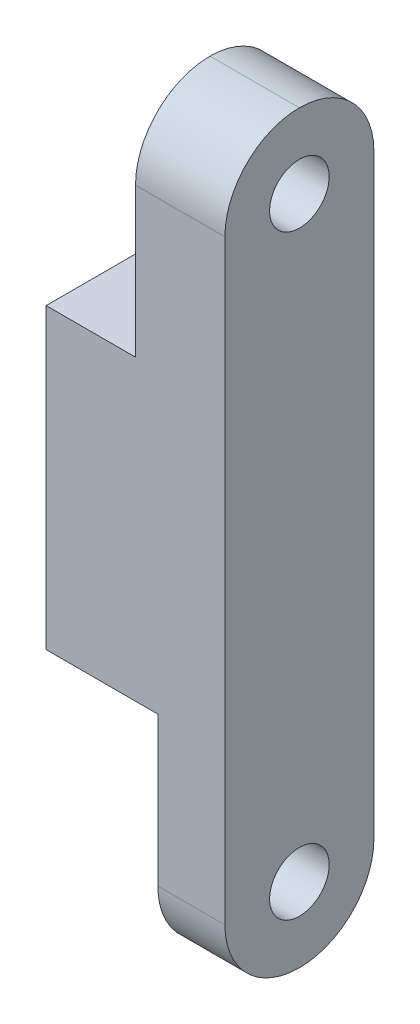
ISO-10303-21;
HEADER;
FILE_DESCRIPTION(('STEP AP214'),'2;1');
FILE_NAME('part.step','',(''),(''),'','','');
FILE_SCHEMA(('AUTOMOTIVE_DESIGN { 1 0 10303 214 1 1 1 1 }'));
ENDSEC;
DATA;
#1=APPLICATION_CONTEXT('core data for automotive mechanical design processes');
#2=APPLICATION_PROTOCOL_DEFINITION('international standard','automotive_design',2000,#1);
#3=PRODUCT_CONTEXT('',#1,'mechanical');
#4=PRODUCT('Part','Part','',(#3));
#5=PRODUCT_RELATED_PRODUCT_CATEGORY('part','',(#4));
#6=PRODUCT_DEFINITION_FORMATION('','',#4);
#7=PRODUCT_DEFINITION_CONTEXT('part definition',#1,'design');
#8=PRODUCT_DEFINITION('design','',#6,#7);
#9=PRODUCT_DEFINITION_SHAPE('','',#8);
#10=(LENGTH_UNIT() NAMED_UNIT(*) SI_UNIT(.MILLI.,.METRE.));
#11=(NAMED_UNIT(*) PLANE_ANGLE_UNIT() SI_UNIT($,.RADIAN.));
#12=(NAMED_UNIT(*) SI_UNIT($,.STERADIAN.) SOLID_ANGLE_UNIT());
#13=UNCERTAINTY_MEASURE_WITH_UNIT(LENGTH_MEASURE(1.E-05),#10,'distance_accuracy_value','');
#14=(GEOMETRIC_REPRESENTATION_CONTEXT(3) GLOBAL_UNCERTAINTY_ASSIGNED_CONTEXT((#13)) GLOBAL_UNIT_ASSIGNED_CONTEXT((#10,
#11,#12)) REPRESENTATION_CONTEXT('',''));
#15=CARTESIAN_POINT('',(0.,0.,0.));
#16=DIRECTION('',(0.,0.,1.));
#17=DIRECTION('',(1.,0.,0.));
#18=AXIS2_PLACEMENT_3D('',#15,#16,#17);
#19=CARTESIAN_POINT('',(-6.,25.,10.));
#20=DIRECTION('',(1.,0.,0.));
#21=DIRECTION('',(0.,1.,0.));
#22=AXIS2_PLACEMENT_3D('',#19,#20,#21);
#23=PLANE('',#22);
#24=DIRECTION('',(0.,-1.,0.));
#25=VECTOR('',#24,1.);
#26=CARTESIAN_POINT('',(-6.,25.,10.));
#27=LINE('',#26,#25);
#28=CARTESIAN_POINT('',(-6.,10.,10.));
#29=VERTEX_POINT('',#28);
#30=CARTESIAN_POINT('',(-6.,-10.,10.));
#31=VERTEX_POINT('',#30);
#32=EDGE_CURVE('E124',#29,#31,#27,.T.);
#33=ORIENTED_EDGE('',*,*,#32,.F.);
#34=DIRECTION('',(0.,0.,1.));
#35=VECTOR('',#34,1.);
#36=CARTESIAN_POINT('',(-6.,10.,0.));
#37=LINE('',#36,#35);
#38=CARTESIAN_POINT('',(-6.,10.,0.));
#39=VERTEX_POINT('',#38);
#40=EDGE_CURVE('E111',#39,#29,#37,.T.);
#41=ORIENTED_EDGE('',*,*,#40,.F.);
#42=DIRECTION('',(0.,-1.,0.));
#43=VECTOR('',#42,1.);
#44=CARTESIAN_POINT('',(-6.,25.,0.));
#45=LINE('',#44,#43);
#46=CARTESIAN_POINT('',(-6.,-10.,0.));
#47=VERTEX_POINT('',#46);
#48=EDGE_CURVE('E122',#39,#47,#45,.T.);
#49=ORIENTED_EDGE('',*,*,#48,.T.);
#50=DIRECTION('',(0.,0.,1.));
#51=VECTOR('',#50,1.);
#52=CARTESIAN_POINT('',(-6.,-10.,0.));
#53=LINE('',#52,#51);
#54=EDGE_CURVE('E131',#47,#31,#53,.T.);
#55=ORIENTED_EDGE('',*,*,#54,.T.);
#56=EDGE_LOOP('',(#33,#41,#49,#55));
#57=FACE_BOUND('',#56,.T.);
#58=ADVANCED_FACE('F33',(#57),#23,.F.);
#59=CARTESIAN_POINT('',(6.,25.,10.));
#60=DIRECTION('',(-1.,0.,0.));
#61=DIRECTION('',(0.,-1.,0.));
#62=AXIS2_PLACEMENT_3D('',#59,#60,#61);
#63=PLANE('',#62);
#64=CARTESIAN_POINT('',(6.,-20.,5.));
#65=DIRECTION('',(-1.,0.,0.));
#66=DIRECTION('',(0.,-1.,0.));
#67=AXIS2_PLACEMENT_3D('',#64,#65,#66);
#68=CIRCLE('',#67,2.);
#69=CARTESIAN_POINT('',(6.,-22.,5.));
#70=VERTEX_POINT('',#69);
#71=EDGE_CURVE('E144',#70,#70,#68,.T.);
#72=ORIENTED_EDGE('',*,*,#71,.T.);
#73=EDGE_LOOP('',(#72));
#74=FACE_BOUND('',#73,.T.);
#75=CARTESIAN_POINT('',(6.,20.,5.));
#76=DIRECTION('',(-1.,0.,0.));
#77=DIRECTION('',(0.,-1.,0.));
#78=AXIS2_PLACEMENT_3D('',#75,#76,#77);
#79=CIRCLE('',#78,2.);
#80=CARTESIAN_POINT('',(6.,18.,5.));
#81=VERTEX_POINT('',#80);
#82=EDGE_CURVE('E206',#81,#81,#79,.T.);
#83=ORIENTED_EDGE('',*,*,#82,.T.);
#84=EDGE_LOOP('',(#83));
#85=FACE_BOUND('',#84,.T.);
#86=DIRECTION('',(0.,1.,0.));
#87=VECTOR('',#86,1.);
#88=CARTESIAN_POINT('',(6.,25.,0.));
#89=LINE('',#88,#87);
#90=CARTESIAN_POINT('',(6.,-20.,0.));
#91=VERTEX_POINT('',#90);
#92=CARTESIAN_POINT('',(6.,20.,0.));
#93=VERTEX_POINT('',#92);
#94=EDGE_CURVE('E130',#91,#93,#89,.T.);
#95=ORIENTED_EDGE('',*,*,#94,.T.);
#96=CARTESIAN_POINT('',(6.,20.,5.));
#97=DIRECTION('',(-1.,0.,0.));
#98=DIRECTION('',(0.,-1.,0.));
#99=AXIS2_PLACEMENT_3D('',#96,#97,#98);
#100=CIRCLE('',#99,5.);
#101=CARTESIAN_POINT('',(6.,25.,5.));
#102=VERTEX_POINT('',#101);
#103=EDGE_CURVE('E162',#93,#102,#100,.F.);
#104=ORIENTED_EDGE('',*,*,#103,.T.);
#105=CARTESIAN_POINT('',(6.,20.,5.));
#106=DIRECTION('',(-1.,0.,0.));
#107=DIRECTION('',(0.,-1.,0.));
#108=AXIS2_PLACEMENT_3D('',#105,#106,#107);
#109=CIRCLE('',#108,5.);
#110=CARTESIAN_POINT('',(6.,20.,10.));
#111=VERTEX_POINT('',#110);
#112=EDGE_CURVE('E160',#102,#111,#109,.F.);
#113=ORIENTED_EDGE('',*,*,#112,.T.);
#114=DIRECTION('',(0.,1.,0.));
#115=VECTOR('',#114,1.);
#116=CARTESIAN_POINT('',(6.,25.,10.));
#117=LINE('',#116,#115);
#118=CARTESIAN_POINT('',(6.,-20.,10.));
#119=VERTEX_POINT('',#118);
#120=EDGE_CURVE('E138',#119,#111,#117,.T.);
#121=ORIENTED_EDGE('',*,*,#120,.F.);
#122=CARTESIAN_POINT('',(6.,-20.,5.));
#123=DIRECTION('',(-1.,0.,0.));
#124=DIRECTION('',(0.,-1.,0.));
#125=AXIS2_PLACEMENT_3D('',#122,#123,#124);
#126=CIRCLE('',#125,5.);
#127=CARTESIAN_POINT('',(6.,-25.,5.));
#128=VERTEX_POINT('',#127);
#129=EDGE_CURVE('E156',#119,#128,#126,.F.);
#130=ORIENTED_EDGE('',*,*,#129,.T.);
#131=CARTESIAN_POINT('',(6.,-20.,5.));
#132=DIRECTION('',(-1.,0.,0.));
#133=DIRECTION('',(0.,-1.,0.));
#134=AXIS2_PLACEMENT_3D('',#131,#132,#133);
#135=CIRCLE('',#134,5.);
#136=EDGE_CURVE('E158',#128,#91,#135,.F.);
#137=ORIENTED_EDGE('',*,*,#136,.T.);
#138=EDGE_LOOP('',(#95,#104,#113,#121,#130,#137));
#139=FACE_BOUND('',#138,.T.);
#140=ADVANCED_FACE('F189',(#74,#85,#139),#63,.F.);
#141=CARTESIAN_POINT('',(0.,0.,10.));
#142=DIRECTION('',(0.,0.,1.));
#143=DIRECTION('',(1.,0.,0.));
#144=AXIS2_PLACEMENT_3D('',#141,#142,#143);
#145=PLANE('',#144);
#146=ORIENTED_EDGE('',*,*,#120,.T.);
#147=DIRECTION('',(-1.,0.,0.));
#148=VECTOR('',#147,1.);
#149=CARTESIAN_POINT('',(0.,20.,10.));
#150=LINE('',#149,#148);
#151=CARTESIAN_POINT('',(0.,20.,10.));
#152=VERTEX_POINT('',#151);
#153=EDGE_CURVE('E166',#111,#152,#150,.T.);
#154=ORIENTED_EDGE('',*,*,#153,.T.);
#155=DIRECTION('',(0.,1.,0.));
#156=VECTOR('',#155,1.);
#157=CARTESIAN_POINT('',(0.,25.,10.));
#158=LINE('',#157,#156);
#159=CARTESIAN_POINT('',(0.,10.,10.));
#160=VERTEX_POINT('',#159);
#161=EDGE_CURVE('E204',#160,#152,#158,.T.);
#162=ORIENTED_EDGE('',*,*,#161,.F.);
#163=DIRECTION('',(1.,0.,0.));
#164=VECTOR('',#163,1.);
#165=CARTESIAN_POINT('',(0.,10.,10.));
#166=LINE('',#165,#164);
#167=EDGE_CURVE('E202',#29,#160,#166,.T.);
#168=ORIENTED_EDGE('',*,*,#167,.F.);
#169=ORIENTED_EDGE('',*,*,#32,.T.);
#170=DIRECTION('',(-1.,0.,0.));
#171=VECTOR('',#170,1.);
#172=CARTESIAN_POINT('',(-6.,-10.,10.));
#173=LINE('',#172,#171);
#174=CARTESIAN_POINT('',(1.5,-10.,10.));
#175=VERTEX_POINT('',#174);
#176=EDGE_CURVE('E195',#175,#31,#173,.T.);
#177=ORIENTED_EDGE('',*,*,#176,.F.);
#178=DIRECTION('',(0.,1.,0.));
#179=VECTOR('',#178,1.);
#180=CARTESIAN_POINT('',(1.5,-25.,10.));
#181=LINE('',#180,#179);
#182=CARTESIAN_POINT('',(1.5,-20.,10.));
#183=VERTEX_POINT('',#182);
#184=EDGE_CURVE('E187',#183,#175,#181,.T.);
#185=ORIENTED_EDGE('',*,*,#184,.F.);
#186=DIRECTION('',(1.,0.,0.));
#187=VECTOR('',#186,1.);
#188=CARTESIAN_POINT('',(6.,-20.,10.));
#189=LINE('',#188,#187);
#190=EDGE_CURVE('E164',#183,#119,#189,.T.);
#191=ORIENTED_EDGE('',*,*,#190,.T.);
#192=EDGE_LOOP('',(#146,#154,#162,#168,#169,#177,#185,#191));
#193=FACE_BOUND('',#192,.T.);
#194=ADVANCED_FACE('F184',(#193),#145,.T.);
#195=CARTESIAN_POINT('',(0.,0.,0.));
#196=DIRECTION('',(0.,0.,1.));
#197=DIRECTION('',(1.,0.,0.));
#198=AXIS2_PLACEMENT_3D('',#195,#196,#197);
#199=PLANE('',#198);
#200=DIRECTION('',(0.,1.,0.));
#201=VECTOR('',#200,1.);
#202=CARTESIAN_POINT('',(0.,25.,0.));
#203=LINE('',#202,#201);
#204=CARTESIAN_POINT('',(0.,10.,0.));
#205=VERTEX_POINT('',#204);
#206=CARTESIAN_POINT('',(0.,20.,0.));
#207=VERTEX_POINT('',#206);
#208=EDGE_CURVE('E117',#205,#207,#203,.T.);
#209=ORIENTED_EDGE('',*,*,#208,.T.);
#210=DIRECTION('',(-1.,0.,0.));
#211=VECTOR('',#210,1.);
#212=CARTESIAN_POINT('',(0.,20.,0.));
#213=LINE('',#212,#211);
#214=EDGE_CURVE('E153',#207,#93,#213,.F.);
#215=ORIENTED_EDGE('',*,*,#214,.T.);
#216=ORIENTED_EDGE('',*,*,#94,.F.);
#217=DIRECTION('',(1.,0.,0.));
#218=VECTOR('',#217,1.);
#219=CARTESIAN_POINT('',(0.,-20.,0.));
#220=LINE('',#219,#218);
#221=CARTESIAN_POINT('',(1.5,-20.,0.));
#222=VERTEX_POINT('',#221);
#223=EDGE_CURVE('E150',#91,#222,#220,.F.);
#224=ORIENTED_EDGE('',*,*,#223,.T.);
#225=DIRECTION('',(0.,1.,0.));
#226=VECTOR('',#225,1.);
#227=CARTESIAN_POINT('',(1.5,-25.,0.));
#228=LINE('',#227,#226);
#229=CARTESIAN_POINT('',(1.5,-10.,0.));
#230=VERTEX_POINT('',#229);
#231=EDGE_CURVE('E197',#222,#230,#228,.T.);
#232=ORIENTED_EDGE('',*,*,#231,.T.);
#233=DIRECTION('',(-1.,0.,0.));
#234=VECTOR('',#233,1.);
#235=CARTESIAN_POINT('',(-6.,-10.,0.));
#236=LINE('',#235,#234);
#237=EDGE_CURVE('E129',#230,#47,#236,.T.);
#238=ORIENTED_EDGE('',*,*,#237,.T.);
#239=ORIENTED_EDGE('',*,*,#48,.F.);
#240=DIRECTION('',(1.,0.,0.));
#241=VECTOR('',#240,1.);
#242=CARTESIAN_POINT('',(0.,10.,0.));
#243=LINE('',#242,#241);
#244=EDGE_CURVE('E107',#39,#205,#243,.T.);
#245=ORIENTED_EDGE('',*,*,#244,.T.);
#246=EDGE_LOOP('',(#209,#215,#216,#224,#232,#238,#239,#245));
#247=FACE_BOUND('',#246,.T.);
#248=ADVANCED_FACE('F127',(#247),#199,.F.);
#249=CARTESIAN_POINT('',(-6.,-10.,0.));
#250=DIRECTION('',(0.,1.,0.));
#251=DIRECTION('',(0.,0.,1.));
#252=AXIS2_PLACEMENT_3D('',#249,#250,#251);
#253=PLANE('',#252);
#254=ORIENTED_EDGE('',*,*,#176,.T.);
#255=ORIENTED_EDGE('',*,*,#54,.F.);
#256=ORIENTED_EDGE('',*,*,#237,.F.);
#257=DIRECTION('',(0.,0.,1.));
#258=VECTOR('',#257,1.);
#259=CARTESIAN_POINT('',(1.5,-10.,0.));
#260=LINE('',#259,#258);
#261=EDGE_CURVE('E135',#230,#175,#260,.T.);
#262=ORIENTED_EDGE('',*,*,#261,.T.);
#263=EDGE_LOOP('',(#254,#255,#256,#262));
#264=FACE_BOUND('',#263,.T.);
#265=ADVANCED_FACE('F281',(#264),#253,.F.);
#266=CARTESIAN_POINT('',(1.5,-25.,0.));
#267=DIRECTION('',(1.,0.,0.));
#268=DIRECTION('',(0.,0.,-1.));
#269=AXIS2_PLACEMENT_3D('',#266,#267,#268);
#270=PLANE('',#269);
#271=CARTESIAN_POINT('',(1.5,-20.,5.));
#272=DIRECTION('',(1.,0.,0.));
#273=DIRECTION('',(0.,0.,-1.));
#274=AXIS2_PLACEMENT_3D('',#271,#272,#273);
#275=CIRCLE('',#274,2.);
#276=CARTESIAN_POINT('',(1.5,-20.,3.));
#277=VERTEX_POINT('',#276);
#278=EDGE_CURVE('E141',#277,#277,#275,.T.);
#279=ORIENTED_EDGE('',*,*,#278,.T.);
#280=EDGE_LOOP('',(#279));
#281=FACE_BOUND('',#280,.T.);
#282=ORIENTED_EDGE('',*,*,#231,.F.);
#283=CARTESIAN_POINT('',(1.5,-20.,5.));
#284=DIRECTION('',(1.,0.,0.));
#285=DIRECTION('',(0.,0.,-1.));
#286=AXIS2_PLACEMENT_3D('',#283,#284,#285);
#287=CIRCLE('',#286,5.);
#288=CARTESIAN_POINT('',(1.5,-25.,5.));
#289=VERTEX_POINT('',#288);
#290=EDGE_CURVE('E11',#222,#289,#287,.F.);
#291=ORIENTED_EDGE('',*,*,#290,.T.);
#292=CARTESIAN_POINT('',(1.5,-20.,5.));
#293=DIRECTION('',(1.,0.,0.));
#294=DIRECTION('',(0.,0.,-1.));
#295=AXIS2_PLACEMENT_3D('',#292,#293,#294);
#296=CIRCLE('',#295,5.);
#297=EDGE_CURVE('E42',#289,#183,#296,.F.);
#298=ORIENTED_EDGE('',*,*,#297,.T.);
#299=ORIENTED_EDGE('',*,*,#184,.T.);
#300=ORIENTED_EDGE('',*,*,#261,.F.);
#301=EDGE_LOOP('',(#282,#291,#298,#299,#300));
#302=FACE_BOUND('',#301,.T.);
#303=ADVANCED_FACE('F269',(#281,#302),#270,.F.);
#304=CARTESIAN_POINT('',(0.,25.,0.));
#305=DIRECTION('',(1.,0.,0.));
#306=DIRECTION('',(0.,1.,0.));
#307=AXIS2_PLACEMENT_3D('',#304,#305,#306);
#308=PLANE('',#307);
#309=CARTESIAN_POINT('',(0.,20.,5.));
#310=DIRECTION('',(-1.,0.,0.));
#311=DIRECTION('',(0.,-1.,0.));
#312=AXIS2_PLACEMENT_3D('',#309,#310,#311);
#313=CIRCLE('',#312,2.);
#314=CARTESIAN_POINT('',(0.,18.,5.));
#315=VERTEX_POINT('',#314);
#316=EDGE_CURVE('E211',#315,#315,#313,.T.);
#317=ORIENTED_EDGE('',*,*,#316,.F.);
#318=EDGE_LOOP('',(#317));
#319=FACE_BOUND('',#318,.T.);
#320=CARTESIAN_POINT('',(0.,20.,5.));
#321=DIRECTION('',(1.,0.,0.));
#322=DIRECTION('',(0.,1.,0.));
#323=AXIS2_PLACEMENT_3D('',#320,#321,#322);
#324=CIRCLE('',#323,5.);
#325=CARTESIAN_POINT('',(0.,25.,5.));
#326=VERTEX_POINT('',#325);
#327=EDGE_CURVE('E146',#152,#326,#324,.F.);
#328=ORIENTED_EDGE('',*,*,#327,.T.);
#329=CARTESIAN_POINT('',(0.,20.,5.));
#330=DIRECTION('',(1.,0.,0.));
#331=DIRECTION('',(0.,1.,0.));
#332=AXIS2_PLACEMENT_3D('',#329,#330,#331);
#333=CIRCLE('',#332,5.);
#334=EDGE_CURVE('E148',#326,#207,#333,.F.);
#335=ORIENTED_EDGE('',*,*,#334,.T.);
#336=ORIENTED_EDGE('',*,*,#208,.F.);
#337=DIRECTION('',(0.,0.,1.));
#338=VECTOR('',#337,1.);
#339=CARTESIAN_POINT('',(0.,10.,0.));
#340=LINE('',#339,#338);
#341=EDGE_CURVE('E113',#205,#160,#340,.T.);
#342=ORIENTED_EDGE('',*,*,#341,.T.);
#343=ORIENTED_EDGE('',*,*,#161,.T.);
#344=EDGE_LOOP('',(#328,#335,#336,#342,#343));
#345=FACE_BOUND('',#344,.T.);
#346=ADVANCED_FACE('F264',(#319,#345),#308,.F.);
#347=CARTESIAN_POINT('',(0.,10.,0.));
#348=DIRECTION('',(0.,-1.,0.));
#349=DIRECTION('',(0.,0.,-1.));
#350=AXIS2_PLACEMENT_3D('',#347,#348,#349);
#351=PLANE('',#350);
#352=ORIENTED_EDGE('',*,*,#167,.T.);
#353=ORIENTED_EDGE('',*,*,#341,.F.);
#354=ORIENTED_EDGE('',*,*,#244,.F.);
#355=ORIENTED_EDGE('',*,*,#40,.T.);
#356=EDGE_LOOP('',(#352,#353,#354,#355));
#357=FACE_BOUND('',#356,.T.);
#358=ADVANCED_FACE('F110',(#357),#351,.F.);
#359=CARTESIAN_POINT('',(9.99999999999999,20.,5.));
#360=DIRECTION('',(-1.,0.,0.));
#361=DIRECTION('',(0.,-1.,0.));
#362=AXIS2_PLACEMENT_3D('',#359,#360,#361);
#363=CYLINDRICAL_SURFACE('',#362,2.);
#364=ORIENTED_EDGE('',*,*,#316,.T.);
#365=EDGE_LOOP('',(#364));
#366=FACE_BOUND('',#365,.T.);
#367=ORIENTED_EDGE('',*,*,#82,.F.);
#368=EDGE_LOOP('',(#367));
#369=FACE_BOUND('',#368,.T.);
#370=ADVANCED_FACE('F222',(#366,#369),#363,.F.);
#371=CARTESIAN_POINT('',(10.,-20.,5.));
#372=DIRECTION('',(-1.,0.,0.));
#373=DIRECTION('',(0.,-1.,0.));
#374=AXIS2_PLACEMENT_3D('',#371,#372,#373);
#375=CYLINDRICAL_SURFACE('',#374,2.);
#376=ORIENTED_EDGE('',*,*,#278,.F.);
#377=EDGE_LOOP('',(#376));
#378=FACE_BOUND('',#377,.T.);
#379=ORIENTED_EDGE('',*,*,#71,.F.);
#380=EDGE_LOOP('',(#379));
#381=FACE_BOUND('',#380,.T.);
#382=ADVANCED_FACE('F219',(#378,#381),#375,.F.);
#383=CARTESIAN_POINT('',(0.,20.,5.));
#384=DIRECTION('',(1.,0.,0.));
#385=DIRECTION('',(0.,0.,-1.));
#386=AXIS2_PLACEMENT_3D('',#383,#384,#385);
#387=CYLINDRICAL_SURFACE('',#386,5.);
#388=ORIENTED_EDGE('',*,*,#153,.F.);
#389=ORIENTED_EDGE('',*,*,#112,.F.);
#390=DIRECTION('',(-1.,0.,0.));
#391=VECTOR('',#390,1.);
#392=CARTESIAN_POINT('',(6.,25.,5.));
#393=LINE('',#392,#391);
#394=EDGE_CURVE('E145',#326,#102,#393,.F.);
#395=ORIENTED_EDGE('',*,*,#394,.F.);
#396=ORIENTED_EDGE('',*,*,#327,.F.);
#397=EDGE_LOOP('',(#388,#389,#395,#396));
#398=FACE_BOUND('',#397,.T.);
#399=ADVANCED_FACE('F221',(#398),#387,.T.);
#400=CARTESIAN_POINT('',(-6.,20.,5.));
#401=DIRECTION('',(-1.,0.,0.));
#402=DIRECTION('',(0.,0.,1.));
#403=AXIS2_PLACEMENT_3D('',#400,#401,#402);
#404=CYLINDRICAL_SURFACE('',#403,5.);
#405=ORIENTED_EDGE('',*,*,#103,.F.);
#406=ORIENTED_EDGE('',*,*,#214,.F.);
#407=ORIENTED_EDGE('',*,*,#334,.F.);
#408=ORIENTED_EDGE('',*,*,#394,.T.);
#409=EDGE_LOOP('',(#405,#406,#407,#408));
#410=FACE_BOUND('',#409,.T.);
#411=ADVANCED_FACE('F229',(#410),#404,.T.);
#412=CARTESIAN_POINT('',(0.,-20.,5.));
#413=DIRECTION('',(-1.,0.,0.));
#414=DIRECTION('',(0.,0.,1.));
#415=AXIS2_PLACEMENT_3D('',#412,#413,#414);
#416=CYLINDRICAL_SURFACE('',#415,5.);
#417=ORIENTED_EDGE('',*,*,#190,.F.);
#418=ORIENTED_EDGE('',*,*,#297,.F.);
#419=DIRECTION('',(1.,0.,0.));
#420=VECTOR('',#419,1.);
#421=CARTESIAN_POINT('',(1.5,-25.,5.));
#422=LINE('',#421,#420);
#423=EDGE_CURVE('E37',#128,#289,#422,.F.);
#424=ORIENTED_EDGE('',*,*,#423,.F.);
#425=ORIENTED_EDGE('',*,*,#129,.F.);
#426=EDGE_LOOP('',(#417,#418,#424,#425));
#427=FACE_BOUND('',#426,.T.);
#428=ADVANCED_FACE('F35',(#427),#416,.T.);
#429=CARTESIAN_POINT('',(-6.,-20.,5.));
#430=DIRECTION('',(1.,0.,0.));
#431=DIRECTION('',(0.,0.,-1.));
#432=AXIS2_PLACEMENT_3D('',#429,#430,#431);
#433=CYLINDRICAL_SURFACE('',#432,5.);
#434=ORIENTED_EDGE('',*,*,#290,.F.);
#435=ORIENTED_EDGE('',*,*,#223,.F.);
#436=ORIENTED_EDGE('',*,*,#136,.F.);
#437=ORIENTED_EDGE('',*,*,#423,.T.);
#438=EDGE_LOOP('',(#434,#435,#436,#437));
#439=FACE_BOUND('',#438,.T.);
#440=ADVANCED_FACE('F176',(#439),#433,.T.);
#441=CLOSED_SHELL('',(#58,#140,#194,#248,#265,#303,#346,#358,#370,#382,#399,#411,#428,#440));
#442=MANIFOLD_SOLID_BREP('B2',#441);
#443=ADVANCED_BREP_SHAPE_REPRESENTATION('',(#18,#442),#14);
#444=SHAPE_DEFINITION_REPRESENTATION(#9,#443);
ENDSEC;
END-ISO-10303-21;
